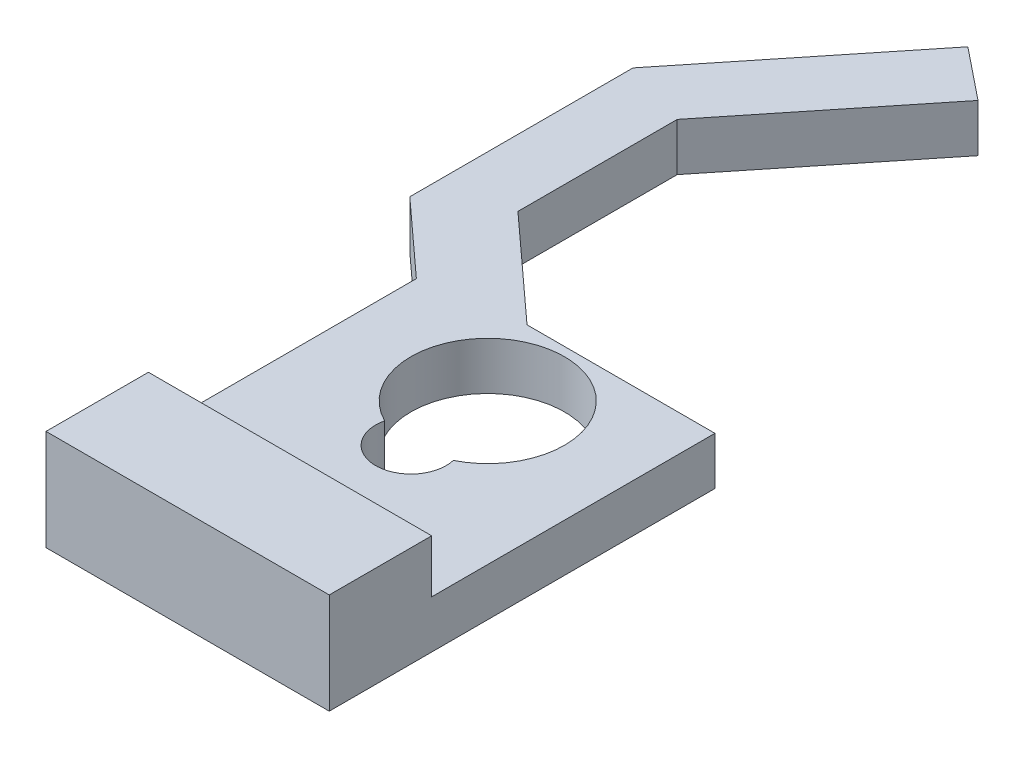
ISO-10303-21;
HEADER;
FILE_DESCRIPTION(('STEP AP214'),'2;1');
FILE_NAME('part.step','',(''),(''),'','','');
FILE_SCHEMA(('AUTOMOTIVE_DESIGN { 1 0 10303 214 1 1 1 1 }'));
ENDSEC;
DATA;
#1=APPLICATION_CONTEXT('core data for automotive mechanical design processes');
#2=APPLICATION_PROTOCOL_DEFINITION('international standard','automotive_design',2000,#1);
#3=PRODUCT_CONTEXT('',#1,'mechanical');
#4=PRODUCT('Part','Part','',(#3));
#5=PRODUCT_RELATED_PRODUCT_CATEGORY('part','',(#4));
#6=PRODUCT_DEFINITION_FORMATION('','',#4);
#7=PRODUCT_DEFINITION_CONTEXT('part definition',#1,'design');
#8=PRODUCT_DEFINITION('design','',#6,#7);
#9=PRODUCT_DEFINITION_SHAPE('','',#8);
#10=(LENGTH_UNIT() NAMED_UNIT(*) SI_UNIT(.MILLI.,.METRE.));
#11=(NAMED_UNIT(*) PLANE_ANGLE_UNIT() SI_UNIT($,.RADIAN.));
#12=(NAMED_UNIT(*) SI_UNIT($,.STERADIAN.) SOLID_ANGLE_UNIT());
#13=UNCERTAINTY_MEASURE_WITH_UNIT(LENGTH_MEASURE(1.E-05),#10,'distance_accuracy_value','');
#14=(GEOMETRIC_REPRESENTATION_CONTEXT(3) GLOBAL_UNCERTAINTY_ASSIGNED_CONTEXT((#13)) GLOBAL_UNIT_ASSIGNED_CONTEXT((#10,
#11,#12)) REPRESENTATION_CONTEXT('',''));
#15=CARTESIAN_POINT('',(0.,0.,0.));
#16=DIRECTION('',(0.,0.,1.));
#17=DIRECTION('',(1.,0.,0.));
#18=AXIS2_PLACEMENT_3D('',#15,#16,#17);
#19=CARTESIAN_POINT('',(-11.25,31.8198051533946,-6.8));
#20=DIRECTION('',(0.,0.,-1.));
#21=DIRECTION('',(-1.,0.,0.));
#22=AXIS2_PLACEMENT_3D('',#19,#20,#21);
#23=PLANE('',#22);
#24=DIRECTION('',(1.,0.,0.));
#25=VECTOR('',#24,1.);
#26=CARTESIAN_POINT('',(-11.25,-3.8,-6.8));
#27=LINE('',#26,#25);
#28=CARTESIAN_POINT('',(-3.67610669277521,-3.8,-6.8));
#29=VERTEX_POINT('',#28);
#30=CARTESIAN_POINT('',(11.25,-3.8,-6.8));
#31=VERTEX_POINT('',#30);
#32=EDGE_CURVE('E232',#29,#31,#27,.T.);
#33=ORIENTED_EDGE('',*,*,#32,.F.);
#34=DIRECTION('',(0.,1.,0.));
#35=VECTOR('',#34,1.);
#36=CARTESIAN_POINT('',(-3.67610669277521,-52.8760814087468,-6.8));
#37=LINE('',#36,#35);
#38=CARTESIAN_POINT('',(-3.67610669277521,0.,-6.8));
#39=VERTEX_POINT('',#38);
#40=EDGE_CURVE('E13',#29,#39,#37,.T.);
#41=ORIENTED_EDGE('',*,*,#40,.T.);
#42=DIRECTION('',(1.,0.,0.));
#43=VECTOR('',#42,1.);
#44=CARTESIAN_POINT('',(-11.25,0.,-6.8));
#45=LINE('',#44,#43);
#46=CARTESIAN_POINT('',(11.25,0.,-6.8));
#47=VERTEX_POINT('',#46);
#48=EDGE_CURVE('E231',#39,#47,#45,.T.);
#49=ORIENTED_EDGE('',*,*,#48,.T.);
#50=DIRECTION('',(0.,-1.,0.));
#51=VECTOR('',#50,1.);
#52=CARTESIAN_POINT('',(11.25,31.8198051533946,-6.8));
#53=LINE('',#52,#51);
#54=EDGE_CURVE('E240',#47,#31,#53,.T.);
#55=ORIENTED_EDGE('',*,*,#54,.T.);
#56=EDGE_LOOP('',(#33,#41,#49,#55));
#57=FACE_BOUND('',#56,.T.);
#58=ADVANCED_FACE('F55',(#57),#23,.T.);
#59=CARTESIAN_POINT('',(11.25,31.8198051533946,-6.8));
#60=DIRECTION('',(1.,0.,0.));
#61=DIRECTION('',(0.,0.,-1.));
#62=AXIS2_PLACEMENT_3D('',#59,#60,#61);
#63=PLANE('',#62);
#64=ORIENTED_EDGE('',*,*,#54,.F.);
#65=DIRECTION('',(0.,0.,1.));
#66=VECTOR('',#65,1.);
#67=CARTESIAN_POINT('',(11.25,0.,-6.8));
#68=LINE('',#67,#66);
#69=CARTESIAN_POINT('',(11.25,0.,15.7));
#70=VERTEX_POINT('',#69);
#71=EDGE_CURVE('E247',#47,#70,#68,.T.);
#72=ORIENTED_EDGE('',*,*,#71,.T.);
#73=DIRECTION('',(0.,-1.,0.));
#74=VECTOR('',#73,1.);
#75=CARTESIAN_POINT('',(11.25,4.2,15.7));
#76=LINE('',#75,#74);
#77=CARTESIAN_POINT('',(11.25,4.2,15.7));
#78=VERTEX_POINT('',#77);
#79=EDGE_CURVE('E175',#78,#70,#76,.T.);
#80=ORIENTED_EDGE('',*,*,#79,.F.);
#81=DIRECTION('',(0.,0.,1.));
#82=VECTOR('',#81,1.);
#83=CARTESIAN_POINT('',(11.25,4.2,23.8359933764455));
#84=LINE('',#83,#82);
#85=CARTESIAN_POINT('',(11.25,4.2,23.8359933764455));
#86=VERTEX_POINT('',#85);
#87=EDGE_CURVE('E186',#78,#86,#84,.T.);
#88=ORIENTED_EDGE('',*,*,#87,.T.);
#89=DIRECTION('',(0.,-1.,0.));
#90=VECTOR('',#89,1.);
#91=CARTESIAN_POINT('',(11.25,4.2,23.8359933764455));
#92=LINE('',#91,#90);
#93=CARTESIAN_POINT('',(11.25,-3.8,23.8359933764455));
#94=VERTEX_POINT('',#93);
#95=EDGE_CURVE('E206',#86,#94,#92,.T.);
#96=ORIENTED_EDGE('',*,*,#95,.T.);
#97=DIRECTION('',(0.,0.,1.));
#98=VECTOR('',#97,1.);
#99=CARTESIAN_POINT('',(11.25,-3.8,-6.8));
#100=LINE('',#99,#98);
#101=EDGE_CURVE('E228',#31,#94,#100,.T.);
#102=ORIENTED_EDGE('',*,*,#101,.F.);
#103=EDGE_LOOP('',(#64,#72,#80,#88,#96,#102));
#104=FACE_BOUND('',#103,.T.);
#105=ADVANCED_FACE('F333',(#104),#63,.T.);
#106=CARTESIAN_POINT('',(-11.25,31.8198051533946,-6.8));
#107=DIRECTION('',(-1.,0.,0.));
#108=DIRECTION('',(0.,0.,1.));
#109=AXIS2_PLACEMENT_3D('',#106,#107,#108);
#110=PLANE('',#109);
#111=DIRECTION('',(0.,0.,-1.));
#112=VECTOR('',#111,1.);
#113=CARTESIAN_POINT('',(-11.25,0.,-6.8));
#114=LINE('',#113,#112);
#115=CARTESIAN_POINT('',(-11.25,0.,15.7));
#116=VERTEX_POINT('',#115);
#117=CARTESIAN_POINT('',(-11.25,0.,-5.58436768113727));
#118=VERTEX_POINT('',#117);
#119=EDGE_CURVE('E241',#116,#118,#114,.T.);
#120=ORIENTED_EDGE('',*,*,#119,.T.);
#121=DIRECTION('',(0.,-1.,0.));
#122=VECTOR('',#121,1.);
#123=CARTESIAN_POINT('',(-11.25,-52.8760814087468,-5.58436768113728));
#124=LINE('',#123,#122);
#125=CARTESIAN_POINT('',(-11.25,-3.8,-5.58436768113728));
#126=VERTEX_POINT('',#125);
#127=EDGE_CURVE('E64',#118,#126,#124,.T.);
#128=ORIENTED_EDGE('',*,*,#127,.T.);
#129=DIRECTION('',(0.,0.,-1.));
#130=VECTOR('',#129,1.);
#131=CARTESIAN_POINT('',(-11.25,-3.8,-6.8));
#132=LINE('',#131,#130);
#133=CARTESIAN_POINT('',(-11.25,-3.8,23.8359933764455));
#134=VERTEX_POINT('',#133);
#135=EDGE_CURVE('E227',#134,#126,#132,.T.);
#136=ORIENTED_EDGE('',*,*,#135,.F.);
#137=DIRECTION('',(0.,-1.,0.));
#138=VECTOR('',#137,1.);
#139=CARTESIAN_POINT('',(-11.25,4.2,23.8359933764455));
#140=LINE('',#139,#138);
#141=CARTESIAN_POINT('',(-11.25,4.2,23.8359933764455));
#142=VERTEX_POINT('',#141);
#143=EDGE_CURVE('E191',#142,#134,#140,.T.);
#144=ORIENTED_EDGE('',*,*,#143,.F.);
#145=DIRECTION('',(0.,0.,-1.));
#146=VECTOR('',#145,1.);
#147=CARTESIAN_POINT('',(-11.25,4.2,23.8359933764455));
#148=LINE('',#147,#146);
#149=CARTESIAN_POINT('',(-11.25,4.2,15.7));
#150=VERTEX_POINT('',#149);
#151=EDGE_CURVE('E183',#142,#150,#148,.T.);
#152=ORIENTED_EDGE('',*,*,#151,.T.);
#153=DIRECTION('',(0.,-1.,0.));
#154=VECTOR('',#153,1.);
#155=CARTESIAN_POINT('',(-11.25,4.2,15.7));
#156=LINE('',#155,#154);
#157=EDGE_CURVE('E165',#150,#116,#156,.T.);
#158=ORIENTED_EDGE('',*,*,#157,.T.);
#159=EDGE_LOOP('',(#120,#128,#136,#144,#152,#158));
#160=FACE_BOUND('',#159,.T.);
#161=ADVANCED_FACE('F189',(#160),#110,.T.);
#162=CARTESIAN_POINT('',(0.,0.,0.));
#163=DIRECTION('',(0.,1.,0.));
#164=DIRECTION('',(0.,0.,1.));
#165=AXIS2_PLACEMENT_3D('',#162,#163,#164);
#166=PLANE('',#165);
#167=CARTESIAN_POINT('',(0.,0.,0.));
#168=DIRECTION('',(0.,1.,0.));
#169=DIRECTION('',(0.,0.,1.));
#170=AXIS2_PLACEMENT_3D('',#167,#168,#169);
#171=CIRCLE('',#170,6.1);
#172=CARTESIAN_POINT('',(2.72525883964805,0.,5.45737704918033));
#173=VERTEX_POINT('',#172);
#174=CARTESIAN_POINT('',(-2.72525883964805,0.,5.45737704918033));
#175=VERTEX_POINT('',#174);
#176=EDGE_CURVE('E224',#173,#175,#171,.T.);
#177=ORIENTED_EDGE('',*,*,#176,.F.);
#178=CARTESIAN_POINT('',(0.,0.,6.1));
#179=DIRECTION('',(0.,1.,0.));
#180=DIRECTION('',(0.,0.,1.));
#181=AXIS2_PLACEMENT_3D('',#178,#179,#180);
#182=CIRCLE('',#181,2.8);
#183=EDGE_CURVE('E221',#175,#173,#182,.T.);
#184=ORIENTED_EDGE('',*,*,#183,.F.);
#185=EDGE_LOOP('',(#177,#184));
#186=FACE_BOUND('',#185,.T.);
#187=ORIENTED_EDGE('',*,*,#48,.F.);
#188=DIRECTION('',(-0.739130434782609,0.,-0.67356232107955));
#189=VECTOR('',#188,1.);
#190=CARTESIAN_POINT('',(0.,0.,-3.45));
#191=LINE('',#190,#189);
#192=CARTESIAN_POINT('',(-11.8414314072586,0.,-14.24098038484));
#193=VERTEX_POINT('',#192);
#194=EDGE_CURVE('E282',#39,#193,#191,.T.);
#195=ORIENTED_EDGE('',*,*,#194,.T.);
#196=DIRECTION('',(0.,0.,-1.));
#197=VECTOR('',#196,1.);
#198=CARTESIAN_POINT('',(-11.8414314072586,0.,-14.24098038484));
#199=LINE('',#198,#197);
#200=CARTESIAN_POINT('',(-11.8414314072586,0.,-26.89843186157));
#201=VERTEX_POINT('',#200);
#202=EDGE_CURVE('E285',#193,#201,#199,.T.);
#203=ORIENTED_EDGE('',*,*,#202,.T.);
#204=DIRECTION('',(0.62619636603135,0.,-0.779665384103419));
#205=VECTOR('',#204,1.);
#206=CARTESIAN_POINT('',(-11.8414314072586,0.,-26.89843186157));
#207=LINE('',#206,#205);
#208=CARTESIAN_POINT('',(-1.2003197202488,0.,-40.1474810109938));
#209=VERTEX_POINT('',#208);
#210=EDGE_CURVE('E289',#201,#209,#207,.T.);
#211=ORIENTED_EDGE('',*,*,#210,.T.);
#212=DIRECTION('',(-0.779665384103419,0.,-0.62619636603135));
#213=VECTOR('',#212,1.);
#214=CARTESIAN_POINT('',(-1.2003197202488,0.,-40.1474810109938));
#215=LINE('',#214,#213);
#216=CARTESIAN_POINT('',(-5.29372237238769,0.,-43.4351399448582));
#217=VERTEX_POINT('',#216);
#218=EDGE_CURVE('E293',#209,#217,#215,.T.);
#219=ORIENTED_EDGE('',*,*,#218,.T.);
#220=DIRECTION('',(-0.62619636603135,0.,0.779665384103419));
#221=VECTOR('',#220,1.);
#222=CARTESIAN_POINT('',(-5.29372237238769,0.,-43.4351399448582));
#223=LINE('',#222,#221);
#224=CARTESIAN_POINT('',(-17.1414314072586,0.,-28.6837790036231));
#225=VERTEX_POINT('',#224);
#226=EDGE_CURVE('E297',#217,#225,#223,.T.);
#227=ORIENTED_EDGE('',*,*,#226,.T.);
#228=DIRECTION('',(0.,0.,1.));
#229=VECTOR('',#228,1.);
#230=CARTESIAN_POINT('',(-17.1414314072586,0.,-28.6837790036231));
#231=LINE('',#230,#229);
#232=CARTESIAN_POINT('',(-17.1414314072586,0.,-10.9531713812869));
#233=VERTEX_POINT('',#232);
#234=EDGE_CURVE('E244',#225,#233,#231,.T.);
#235=ORIENTED_EDGE('',*,*,#234,.T.);
#236=DIRECTION('',(0.739130434782609,0.,0.67356232107955));
#237=VECTOR('',#236,1.);
#238=CARTESIAN_POINT('',(-17.1414314072586,0.,-10.9531713812869));
#239=LINE('',#238,#237);
#240=EDGE_CURVE('E278',#233,#118,#239,.T.);
#241=ORIENTED_EDGE('',*,*,#240,.T.);
#242=ORIENTED_EDGE('',*,*,#119,.F.);
#243=DIRECTION('',(-1.,0.,0.));
#244=VECTOR('',#243,1.);
#245=CARTESIAN_POINT('',(-11.25,0.,15.7));
#246=LINE('',#245,#244);
#247=EDGE_CURVE('E170',#70,#116,#246,.T.);
#248=ORIENTED_EDGE('',*,*,#247,.F.);
#249=ORIENTED_EDGE('',*,*,#71,.F.);
#250=EDGE_LOOP('',(#187,#195,#203,#211,#219,#227,#235,#241,#242,#248,#249));
#251=FACE_BOUND('',#250,.T.);
#252=ADVANCED_FACE('F57',(#186,#251),#166,.T.);
#253=CARTESIAN_POINT('',(0.,-3.8,0.));
#254=DIRECTION('',(0.,1.,0.));
#255=DIRECTION('',(0.,0.,1.));
#256=AXIS2_PLACEMENT_3D('',#253,#254,#255);
#257=PLANE('',#256);
#258=CARTESIAN_POINT('',(0.,-3.8,6.1));
#259=DIRECTION('',(0.,-1.,0.));
#260=DIRECTION('',(0.,0.,-1.));
#261=AXIS2_PLACEMENT_3D('',#258,#259,#260);
#262=CIRCLE('',#261,2.8);
#263=CARTESIAN_POINT('',(2.72525883964805,-3.8,5.45737704918033));
#264=VERTEX_POINT('',#263);
#265=CARTESIAN_POINT('',(-2.72525883964805,-3.8,5.45737704918033));
#266=VERTEX_POINT('',#265);
#267=EDGE_CURVE('E205',#264,#266,#262,.T.);
#268=ORIENTED_EDGE('',*,*,#267,.F.);
#269=CARTESIAN_POINT('',(0.,-3.8,0.));
#270=DIRECTION('',(0.,-1.,0.));
#271=DIRECTION('',(0.,0.,-1.));
#272=AXIS2_PLACEMENT_3D('',#269,#270,#271);
#273=CIRCLE('',#272,6.1);
#274=EDGE_CURVE('E78',#266,#264,#273,.T.);
#275=ORIENTED_EDGE('',*,*,#274,.F.);
#276=EDGE_LOOP('',(#268,#275));
#277=FACE_BOUND('',#276,.T.);
#278=DIRECTION('',(0.739130434782609,0.,0.67356232107955));
#279=VECTOR('',#278,1.);
#280=CARTESIAN_POINT('',(0.,-3.8,-3.45));
#281=LINE('',#280,#279);
#282=CARTESIAN_POINT('',(-11.8414314072586,-3.8,-14.24098038484));
#283=VERTEX_POINT('',#282);
#284=EDGE_CURVE('E254',#283,#29,#281,.T.);
#285=ORIENTED_EDGE('',*,*,#284,.T.);
#286=ORIENTED_EDGE('',*,*,#32,.T.);
#287=ORIENTED_EDGE('',*,*,#101,.T.);
#288=DIRECTION('',(-1.,0.,0.));
#289=VECTOR('',#288,1.);
#290=CARTESIAN_POINT('',(-11.25,-3.8,23.8359933764455));
#291=LINE('',#290,#289);
#292=EDGE_CURVE('E193',#94,#134,#291,.T.);
#293=ORIENTED_EDGE('',*,*,#292,.T.);
#294=ORIENTED_EDGE('',*,*,#135,.T.);
#295=DIRECTION('',(-0.739130434782609,0.,-0.67356232107955));
#296=VECTOR('',#295,1.);
#297=CARTESIAN_POINT('',(-17.1414314072586,-3.8,-10.9531713812869));
#298=LINE('',#297,#296);
#299=CARTESIAN_POINT('',(-17.1414314072586,-3.8,-10.9531713812869));
#300=VERTEX_POINT('',#299);
#301=EDGE_CURVE('E274',#126,#300,#298,.T.);
#302=ORIENTED_EDGE('',*,*,#301,.T.);
#303=DIRECTION('',(0.,0.,-1.));
#304=VECTOR('',#303,1.);
#305=CARTESIAN_POINT('',(-17.1414314072586,-3.8,-28.6837790036231));
#306=LINE('',#305,#304);
#307=CARTESIAN_POINT('',(-17.1414314072586,-3.8,-28.6837790036231));
#308=VERTEX_POINT('',#307);
#309=EDGE_CURVE('E271',#300,#308,#306,.T.);
#310=ORIENTED_EDGE('',*,*,#309,.T.);
#311=DIRECTION('',(0.62619636603135,0.,-0.779665384103419));
#312=VECTOR('',#311,1.);
#313=CARTESIAN_POINT('',(-5.29372237238769,-3.8,-43.4351399448582));
#314=LINE('',#313,#312);
#315=CARTESIAN_POINT('',(-5.29372237238769,-3.8,-43.4351399448582));
#316=VERTEX_POINT('',#315);
#317=EDGE_CURVE('E268',#308,#316,#314,.T.);
#318=ORIENTED_EDGE('',*,*,#317,.T.);
#319=DIRECTION('',(0.779665384103419,0.,0.62619636603135));
#320=VECTOR('',#319,1.);
#321=CARTESIAN_POINT('',(-1.2003197202488,-3.8,-40.1474810109938));
#322=LINE('',#321,#320);
#323=CARTESIAN_POINT('',(-1.20031972024881,-3.8,-40.1474810109938));
#324=VERTEX_POINT('',#323);
#325=EDGE_CURVE('E265',#316,#324,#322,.T.);
#326=ORIENTED_EDGE('',*,*,#325,.T.);
#327=DIRECTION('',(-0.62619636603135,0.,0.779665384103419));
#328=VECTOR('',#327,1.);
#329=CARTESIAN_POINT('',(-11.8414314072586,-3.8,-26.89843186157));
#330=LINE('',#329,#328);
#331=CARTESIAN_POINT('',(-11.8414314072586,-3.8,-26.89843186157));
#332=VERTEX_POINT('',#331);
#333=EDGE_CURVE('E262',#324,#332,#330,.T.);
#334=ORIENTED_EDGE('',*,*,#333,.T.);
#335=DIRECTION('',(0.,0.,1.));
#336=VECTOR('',#335,1.);
#337=CARTESIAN_POINT('',(-11.8414314072586,-3.8,-14.24098038484));
#338=LINE('',#337,#336);
#339=EDGE_CURVE('E258',#332,#283,#338,.T.);
#340=ORIENTED_EDGE('',*,*,#339,.T.);
#341=EDGE_LOOP('',(#285,#286,#287,#293,#294,#302,#310,#318,#326,#334,#340));
#342=FACE_BOUND('',#341,.T.);
#343=ADVANCED_FACE('F325',(#277,#342),#257,.F.);
#344=CARTESIAN_POINT('',(-17.1414314072586,-52.8760814087468,-28.6837790036231));
#345=DIRECTION('',(-1.,0.,0.));
#346=DIRECTION('',(0.,0.,1.));
#347=AXIS2_PLACEMENT_3D('',#344,#345,#346);
#348=PLANE('',#347);
#349=ORIENTED_EDGE('',*,*,#309,.F.);
#350=DIRECTION('',(0.,1.,0.));
#351=VECTOR('',#350,1.);
#352=CARTESIAN_POINT('',(-17.1414314072586,-52.8760814087468,-10.9531713812869));
#353=LINE('',#352,#351);
#354=EDGE_CURVE('E301',#300,#233,#353,.T.);
#355=ORIENTED_EDGE('',*,*,#354,.T.);
#356=ORIENTED_EDGE('',*,*,#234,.F.);
#357=DIRECTION('',(0.,1.,0.));
#358=VECTOR('',#357,1.);
#359=CARTESIAN_POINT('',(-17.1414314072586,-52.8760814087468,-28.6837790036231));
#360=LINE('',#359,#358);
#361=EDGE_CURVE('E259',#308,#225,#360,.T.);
#362=ORIENTED_EDGE('',*,*,#361,.F.);
#363=EDGE_LOOP('',(#349,#355,#356,#362));
#364=FACE_BOUND('',#363,.T.);
#365=ADVANCED_FACE('F341',(#364),#348,.T.);
#366=CARTESIAN_POINT('',(-5.29372237238769,-52.8760814087468,-43.4351399448582));
#367=DIRECTION('',(-0.779665384103419,0.,-0.62619636603135));
#368=DIRECTION('',(-0.62619636603135,0.,0.779665384103419));
#369=AXIS2_PLACEMENT_3D('',#366,#367,#368);
#370=PLANE('',#369);
#371=ORIENTED_EDGE('',*,*,#317,.F.);
#372=ORIENTED_EDGE('',*,*,#361,.T.);
#373=ORIENTED_EDGE('',*,*,#226,.F.);
#374=DIRECTION('',(0.,1.,0.));
#375=VECTOR('',#374,1.);
#376=CARTESIAN_POINT('',(-5.29372237238769,-52.8760814087468,-43.4351399448582));
#377=LINE('',#376,#375);
#378=EDGE_CURVE('E304',#316,#217,#377,.T.);
#379=ORIENTED_EDGE('',*,*,#378,.F.);
#380=EDGE_LOOP('',(#371,#372,#373,#379));
#381=FACE_BOUND('',#380,.T.);
#382=ADVANCED_FACE('F347',(#381),#370,.T.);
#383=CARTESIAN_POINT('',(-1.2003197202488,-52.8760814087468,-40.1474810109938));
#384=DIRECTION('',(0.62619636603135,0.,-0.779665384103419));
#385=DIRECTION('',(-0.779665384103419,0.,-0.62619636603135));
#386=AXIS2_PLACEMENT_3D('',#383,#384,#385);
#387=PLANE('',#386);
#388=ORIENTED_EDGE('',*,*,#325,.F.);
#389=ORIENTED_EDGE('',*,*,#378,.T.);
#390=ORIENTED_EDGE('',*,*,#218,.F.);
#391=DIRECTION('',(0.,1.,0.));
#392=VECTOR('',#391,1.);
#393=CARTESIAN_POINT('',(-1.2003197202488,-52.8760814087468,-40.1474810109938));
#394=LINE('',#393,#392);
#395=EDGE_CURVE('E307',#324,#209,#394,.T.);
#396=ORIENTED_EDGE('',*,*,#395,.F.);
#397=EDGE_LOOP('',(#388,#389,#390,#396));
#398=FACE_BOUND('',#397,.T.);
#399=ADVANCED_FACE('F351',(#398),#387,.T.);
#400=CARTESIAN_POINT('',(-11.8414314072586,-52.8760814087468,-26.89843186157));
#401=DIRECTION('',(0.779665384103419,0.,0.62619636603135));
#402=DIRECTION('',(0.62619636603135,0.,-0.779665384103419));
#403=AXIS2_PLACEMENT_3D('',#400,#401,#402);
#404=PLANE('',#403);
#405=ORIENTED_EDGE('',*,*,#333,.F.);
#406=ORIENTED_EDGE('',*,*,#395,.T.);
#407=ORIENTED_EDGE('',*,*,#210,.F.);
#408=DIRECTION('',(0.,1.,0.));
#409=VECTOR('',#408,1.);
#410=CARTESIAN_POINT('',(-11.8414314072586,-52.8760814087468,-26.89843186157));
#411=LINE('',#410,#409);
#412=EDGE_CURVE('E310',#332,#201,#411,.T.);
#413=ORIENTED_EDGE('',*,*,#412,.F.);
#414=EDGE_LOOP('',(#405,#406,#407,#413));
#415=FACE_BOUND('',#414,.T.);
#416=ADVANCED_FACE('F358',(#415),#404,.T.);
#417=CARTESIAN_POINT('',(-11.8414314072586,-52.8760814087468,-14.24098038484));
#418=DIRECTION('',(1.,0.,0.));
#419=DIRECTION('',(0.,0.,-1.));
#420=AXIS2_PLACEMENT_3D('',#417,#418,#419);
#421=PLANE('',#420);
#422=ORIENTED_EDGE('',*,*,#339,.F.);
#423=ORIENTED_EDGE('',*,*,#412,.T.);
#424=ORIENTED_EDGE('',*,*,#202,.F.);
#425=DIRECTION('',(0.,1.,0.));
#426=VECTOR('',#425,1.);
#427=CARTESIAN_POINT('',(-11.8414314072586,-52.8760814087468,-14.24098038484));
#428=LINE('',#427,#426);
#429=EDGE_CURVE('E313',#283,#193,#428,.T.);
#430=ORIENTED_EDGE('',*,*,#429,.F.);
#431=EDGE_LOOP('',(#422,#423,#424,#430));
#432=FACE_BOUND('',#431,.T.);
#433=ADVANCED_FACE('F363',(#432),#421,.T.);
#434=CARTESIAN_POINT('',(0.,-52.8760814087468,-3.45));
#435=DIRECTION('',(0.67356232107955,0.,-0.739130434782609));
#436=DIRECTION('',(-0.739130434782609,0.,-0.67356232107955));
#437=AXIS2_PLACEMENT_3D('',#434,#435,#436);
#438=PLANE('',#437);
#439=ORIENTED_EDGE('',*,*,#40,.F.);
#440=ORIENTED_EDGE('',*,*,#284,.F.);
#441=ORIENTED_EDGE('',*,*,#429,.T.);
#442=ORIENTED_EDGE('',*,*,#194,.F.);
#443=EDGE_LOOP('',(#439,#440,#441,#442));
#444=FACE_BOUND('',#443,.T.);
#445=ADVANCED_FACE('F365',(#444),#438,.T.);
#446=CARTESIAN_POINT('',(-17.1414314072586,-52.8760814087468,-10.9531713812869));
#447=DIRECTION('',(-0.67356232107955,0.,0.739130434782609));
#448=DIRECTION('',(0.739130434782609,0.,0.67356232107955));
#449=AXIS2_PLACEMENT_3D('',#446,#447,#448);
#450=PLANE('',#449);
#451=ORIENTED_EDGE('',*,*,#127,.F.);
#452=ORIENTED_EDGE('',*,*,#240,.F.);
#453=ORIENTED_EDGE('',*,*,#354,.F.);
#454=ORIENTED_EDGE('',*,*,#301,.F.);
#455=EDGE_LOOP('',(#451,#452,#453,#454));
#456=FACE_BOUND('',#455,.T.);
#457=ADVANCED_FACE('F339',(#456),#450,.T.);
#458=CARTESIAN_POINT('',(0.,6.2,0.));
#459=DIRECTION('',(0.,-1.,0.));
#460=DIRECTION('',(0.,0.,-1.));
#461=AXIS2_PLACEMENT_3D('',#458,#459,#460);
#462=CYLINDRICAL_SURFACE('',#461,6.1);
#463=ORIENTED_EDGE('',*,*,#176,.T.);
#464=DIRECTION('',(0.,-1.,0.));
#465=VECTOR('',#464,1.);
#466=CARTESIAN_POINT('',(-2.72525883964805,1.2,5.45737704918033));
#467=LINE('',#466,#465);
#468=EDGE_CURVE('E71',#175,#266,#467,.T.);
#469=ORIENTED_EDGE('',*,*,#468,.T.);
#470=ORIENTED_EDGE('',*,*,#274,.T.);
#471=DIRECTION('',(0.,-1.,0.));
#472=VECTOR('',#471,1.);
#473=CARTESIAN_POINT('',(2.72525883964805,1.2,5.45737704918033));
#474=LINE('',#473,#472);
#475=EDGE_CURVE('E214',#264,#173,#474,.F.);
#476=ORIENTED_EDGE('',*,*,#475,.T.);
#477=EDGE_LOOP('',(#463,#469,#470,#476));
#478=FACE_BOUND('',#477,.T.);
#479=ADVANCED_FACE('F388',(#478),#462,.F.);
#480=CARTESIAN_POINT('',(0.,6.2,6.1));
#481=DIRECTION('',(0.,-1.,0.));
#482=DIRECTION('',(0.,0.,-1.));
#483=AXIS2_PLACEMENT_3D('',#480,#481,#482);
#484=CYLINDRICAL_SURFACE('',#483,2.8);
#485=ORIENTED_EDGE('',*,*,#183,.T.);
#486=ORIENTED_EDGE('',*,*,#475,.F.);
#487=ORIENTED_EDGE('',*,*,#267,.T.);
#488=ORIENTED_EDGE('',*,*,#468,.F.);
#489=EDGE_LOOP('',(#485,#486,#487,#488));
#490=FACE_BOUND('',#489,.T.);
#491=ADVANCED_FACE('F398',(#490),#484,.F.);
#492=CARTESIAN_POINT('',(-11.25,4.2,23.8359933764455));
#493=DIRECTION('',(0.,0.,1.));
#494=DIRECTION('',(1.,0.,0.));
#495=AXIS2_PLACEMENT_3D('',#492,#493,#494);
#496=PLANE('',#495);
#497=ORIENTED_EDGE('',*,*,#292,.F.);
#498=ORIENTED_EDGE('',*,*,#95,.F.);
#499=DIRECTION('',(-1.,0.,0.));
#500=VECTOR('',#499,1.);
#501=CARTESIAN_POINT('',(-11.25,4.2,23.8359933764455));
#502=LINE('',#501,#500);
#503=EDGE_CURVE('E176',#86,#142,#502,.T.);
#504=ORIENTED_EDGE('',*,*,#503,.T.);
#505=ORIENTED_EDGE('',*,*,#143,.T.);
#506=EDGE_LOOP('',(#497,#498,#504,#505));
#507=FACE_BOUND('',#506,.T.);
#508=ADVANCED_FACE('F330',(#507),#496,.T.);
#509=CARTESIAN_POINT('',(-11.25,4.2,15.7));
#510=DIRECTION('',(0.,0.,-1.));
#511=DIRECTION('',(-1.,0.,0.));
#512=AXIS2_PLACEMENT_3D('',#509,#510,#511);
#513=PLANE('',#512);
#514=ORIENTED_EDGE('',*,*,#79,.T.);
#515=ORIENTED_EDGE('',*,*,#247,.T.);
#516=ORIENTED_EDGE('',*,*,#157,.F.);
#517=DIRECTION('',(1.,0.,0.));
#518=VECTOR('',#517,1.);
#519=CARTESIAN_POINT('',(-11.25,4.2,15.7));
#520=LINE('',#519,#518);
#521=EDGE_CURVE('E169',#150,#78,#520,.T.);
#522=ORIENTED_EDGE('',*,*,#521,.T.);
#523=EDGE_LOOP('',(#514,#515,#516,#522));
#524=FACE_BOUND('',#523,.T.);
#525=ADVANCED_FACE('F168',(#524),#513,.T.);
#526=CARTESIAN_POINT('',(0.,4.2,0.));
#527=DIRECTION('',(0.,-1.,0.));
#528=DIRECTION('',(0.,0.,-1.));
#529=AXIS2_PLACEMENT_3D('',#526,#527,#528);
#530=PLANE('',#529);
#531=ORIENTED_EDGE('',*,*,#151,.F.);
#532=ORIENTED_EDGE('',*,*,#503,.F.);
#533=ORIENTED_EDGE('',*,*,#87,.F.);
#534=ORIENTED_EDGE('',*,*,#521,.F.);
#535=EDGE_LOOP('',(#531,#532,#533,#534));
#536=FACE_BOUND('',#535,.T.);
#537=ADVANCED_FACE('F181',(#536),#530,.F.);
#538=CLOSED_SHELL('',(#58,#105,#161,#252,#343,#365,#382,#399,#416,#433,#445,#457,#479,#491,#508,
#525,#537));
#539=MANIFOLD_SOLID_BREP('B2',#538);
#540=ADVANCED_BREP_SHAPE_REPRESENTATION('',(#18,#539),#14);
#541=SHAPE_DEFINITION_REPRESENTATION(#9,#540);
ENDSEC;
END-ISO-10303-21;
